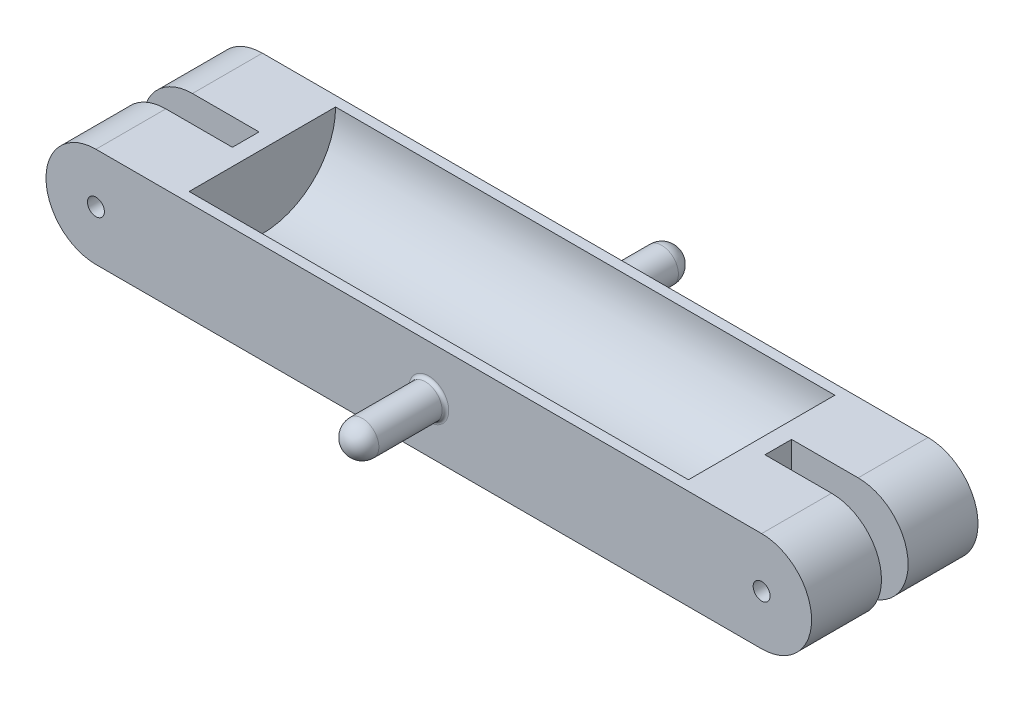
ISO-10303-21;
HEADER;
FILE_DESCRIPTION(('STEP AP214'),'2;1');
FILE_NAME('part.step','',(''),(''),'','','');
FILE_SCHEMA(('AUTOMOTIVE_DESIGN { 1 0 10303 214 1 1 1 1 }'));
ENDSEC;
DATA;
#1=APPLICATION_CONTEXT('core data for automotive mechanical design processes');
#2=APPLICATION_PROTOCOL_DEFINITION('international standard','automotive_design',2000,#1);
#3=PRODUCT_CONTEXT('',#1,'mechanical');
#4=PRODUCT('Part','Part','',(#3));
#5=PRODUCT_RELATED_PRODUCT_CATEGORY('part','',(#4));
#6=PRODUCT_DEFINITION_FORMATION('','',#4);
#7=PRODUCT_DEFINITION_CONTEXT('part definition',#1,'design');
#8=PRODUCT_DEFINITION('design','',#6,#7);
#9=PRODUCT_DEFINITION_SHAPE('','',#8);
#10=(LENGTH_UNIT() NAMED_UNIT(*) SI_UNIT(.MILLI.,.METRE.));
#11=(NAMED_UNIT(*) PLANE_ANGLE_UNIT() SI_UNIT($,.RADIAN.));
#12=(NAMED_UNIT(*) SI_UNIT($,.STERADIAN.) SOLID_ANGLE_UNIT());
#13=UNCERTAINTY_MEASURE_WITH_UNIT(LENGTH_MEASURE(1.E-05),#10,'distance_accuracy_value','');
#14=(GEOMETRIC_REPRESENTATION_CONTEXT(3) GLOBAL_UNCERTAINTY_ASSIGNED_CONTEXT((#13)) GLOBAL_UNIT_ASSIGNED_CONTEXT((#10,
#11,#12)) REPRESENTATION_CONTEXT('',''));
#15=CARTESIAN_POINT('',(0.,0.,0.));
#16=DIRECTION('',(0.,0.,1.));
#17=DIRECTION('',(1.,0.,0.));
#18=AXIS2_PLACEMENT_3D('',#15,#16,#17);
#19=CARTESIAN_POINT('',(0.,15.,50.));
#20=DIRECTION('',(0.,1.,0.));
#21=DIRECTION('',(-1.,0.,0.));
#22=AXIS2_PLACEMENT_3D('',#19,#20,#21);
#23=PLANE('',#22);
#24=DIRECTION('',(0.,0.,1.));
#25=VECTOR('',#24,1.);
#26=CARTESIAN_POINT('',(-80.,15.,29.));
#27=LINE('',#26,#25);
#28=CARTESIAN_POINT('',(-80.,15.,21.));
#29=VERTEX_POINT('',#28);
#30=CARTESIAN_POINT('',(-80.,15.,29.));
#31=VERTEX_POINT('',#30);
#32=EDGE_CURVE('E186',#29,#31,#27,.T.);
#33=ORIENTED_EDGE('',*,*,#32,.T.);
#34=DIRECTION('',(-1.,0.,0.));
#35=VECTOR('',#34,1.);
#36=CARTESIAN_POINT('',(-80.,15.,29.));
#37=LINE('',#36,#35);
#38=CARTESIAN_POINT('',(-100.,15.,29.));
#39=VERTEX_POINT('',#38);
#40=EDGE_CURVE('E196',#31,#39,#37,.T.);
#41=ORIENTED_EDGE('',*,*,#40,.T.);
#42=DIRECTION('',(0.,0.,-1.));
#43=VECTOR('',#42,1.);
#44=CARTESIAN_POINT('',(-100.,15.,50.));
#45=LINE('',#44,#43);
#46=CARTESIAN_POINT('',(-100.,15.,50.));
#47=VERTEX_POINT('',#46);
#48=EDGE_CURVE('E228',#47,#39,#45,.T.);
#49=ORIENTED_EDGE('',*,*,#48,.F.);
#50=DIRECTION('',(1.,0.,0.));
#51=VECTOR('',#50,1.);
#52=CARTESIAN_POINT('',(0.,15.,50.));
#53=LINE('',#52,#51);
#54=CARTESIAN_POINT('',(100.,15.,50.));
#55=VERTEX_POINT('',#54);
#56=EDGE_CURVE('E273',#47,#55,#53,.T.);
#57=ORIENTED_EDGE('',*,*,#56,.T.);
#58=DIRECTION('',(0.,0.,-1.));
#59=VECTOR('',#58,1.);
#60=CARTESIAN_POINT('',(100.,15.,50.));
#61=LINE('',#60,#59);
#62=CARTESIAN_POINT('',(100.,15.,29.));
#63=VERTEX_POINT('',#62);
#64=EDGE_CURVE('E294',#55,#63,#61,.T.);
#65=ORIENTED_EDGE('',*,*,#64,.T.);
#66=DIRECTION('',(1.,0.,0.));
#67=VECTOR('',#66,1.);
#68=CARTESIAN_POINT('',(80.,15.,29.));
#69=LINE('',#68,#67);
#70=CARTESIAN_POINT('',(80.,15.,29.));
#71=VERTEX_POINT('',#70);
#72=EDGE_CURVE('E251',#71,#63,#69,.T.);
#73=ORIENTED_EDGE('',*,*,#72,.F.);
#74=DIRECTION('',(0.,0.,1.));
#75=VECTOR('',#74,1.);
#76=CARTESIAN_POINT('',(80.,15.,29.));
#77=LINE('',#76,#75);
#78=CARTESIAN_POINT('',(80.,15.,21.));
#79=VERTEX_POINT('',#78);
#80=EDGE_CURVE('E177',#79,#71,#77,.T.);
#81=ORIENTED_EDGE('',*,*,#80,.F.);
#82=DIRECTION('',(-1.,0.,0.));
#83=VECTOR('',#82,1.);
#84=CARTESIAN_POINT('',(80.,15.,21.));
#85=LINE('',#84,#83);
#86=CARTESIAN_POINT('',(100.,15.,21.));
#87=VERTEX_POINT('',#86);
#88=EDGE_CURVE('E243',#87,#79,#85,.T.);
#89=ORIENTED_EDGE('',*,*,#88,.F.);
#90=CARTESIAN_POINT('',(100.,15.,0.));
#91=VERTEX_POINT('',#90);
#92=EDGE_CURVE('E281',#87,#91,#61,.T.);
#93=ORIENTED_EDGE('',*,*,#92,.T.);
#94=DIRECTION('',(1.,0.,0.));
#95=VECTOR('',#94,1.);
#96=CARTESIAN_POINT('',(0.,15.,0.));
#97=LINE('',#96,#95);
#98=CARTESIAN_POINT('',(-100.,15.,0.));
#99=VERTEX_POINT('',#98);
#100=EDGE_CURVE('E270',#99,#91,#97,.T.);
#101=ORIENTED_EDGE('',*,*,#100,.F.);
#102=CARTESIAN_POINT('',(-100.,15.,21.));
#103=VERTEX_POINT('',#102);
#104=EDGE_CURVE('E231',#103,#99,#45,.T.);
#105=ORIENTED_EDGE('',*,*,#104,.F.);
#106=DIRECTION('',(1.,0.,0.));
#107=VECTOR('',#106,1.);
#108=CARTESIAN_POINT('',(-80.,15.,21.));
#109=LINE('',#108,#107);
#110=EDGE_CURVE('E189',#103,#29,#109,.T.);
#111=ORIENTED_EDGE('',*,*,#110,.T.);
#112=EDGE_LOOP('',(#33,#41,#49,#57,#65,#73,#81,#89,#93,#101,#105,#111));
#113=FACE_BOUND('',#112,.T.);
#114=DIRECTION('',(-1.,0.,0.));
#115=VECTOR('',#114,1.);
#116=CARTESIAN_POINT('',(75.,15.,47.));
#117=LINE('',#116,#115);
#118=CARTESIAN_POINT('',(75.,15.,47.));
#119=VERTEX_POINT('',#118);
#120=CARTESIAN_POINT('',(-75.,15.,47.));
#121=VERTEX_POINT('',#120);
#122=EDGE_CURVE('E178',#119,#121,#117,.T.);
#123=ORIENTED_EDGE('',*,*,#122,.T.);
#124=DIRECTION('',(0.,0.,-1.));
#125=VECTOR('',#124,1.);
#126=CARTESIAN_POINT('',(-75.,15.,3.));
#127=LINE('',#126,#125);
#128=CARTESIAN_POINT('',(-75.,15.,3.));
#129=VERTEX_POINT('',#128);
#130=EDGE_CURVE('E183',#121,#129,#127,.T.);
#131=ORIENTED_EDGE('',*,*,#130,.T.);
#132=DIRECTION('',(-1.,0.,0.));
#133=VECTOR('',#132,1.);
#134=CARTESIAN_POINT('',(75.,15.,3.));
#135=LINE('',#134,#133);
#136=CARTESIAN_POINT('',(75.,15.,3.));
#137=VERTEX_POINT('',#136);
#138=EDGE_CURVE('E170',#137,#129,#135,.T.);
#139=ORIENTED_EDGE('',*,*,#138,.F.);
#140=DIRECTION('',(0.,0.,-1.));
#141=VECTOR('',#140,1.);
#142=CARTESIAN_POINT('',(75.,15.,3.));
#143=LINE('',#142,#141);
#144=EDGE_CURVE('E236',#119,#137,#143,.T.);
#145=ORIENTED_EDGE('',*,*,#144,.F.);
#146=EDGE_LOOP('',(#123,#131,#139,#145));
#147=FACE_BOUND('',#146,.T.);
#148=ADVANCED_FACE('F69',(#113,#147),#23,.T.);
#149=CARTESIAN_POINT('',(100.,-15.,50.));
#150=DIRECTION('',(0.,-1.,0.));
#151=DIRECTION('',(1.,0.,0.));
#152=AXIS2_PLACEMENT_3D('',#149,#150,#151);
#153=PLANE('',#152);
#154=DIRECTION('',(0.,0.,-1.));
#155=VECTOR('',#154,1.);
#156=CARTESIAN_POINT('',(-100.,-15.,50.));
#157=LINE('',#156,#155);
#158=CARTESIAN_POINT('',(-100.,-15.,50.));
#159=VERTEX_POINT('',#158);
#160=CARTESIAN_POINT('',(-100.,-15.,29.));
#161=VERTEX_POINT('',#160);
#162=EDGE_CURVE('E232',#159,#161,#157,.T.);
#163=ORIENTED_EDGE('',*,*,#162,.T.);
#164=DIRECTION('',(-1.,0.,0.));
#165=VECTOR('',#164,1.);
#166=CARTESIAN_POINT('',(-80.,-15.,29.));
#167=LINE('',#166,#165);
#168=CARTESIAN_POINT('',(-80.,-15.,29.));
#169=VERTEX_POINT('',#168);
#170=EDGE_CURVE('E198',#169,#161,#167,.T.);
#171=ORIENTED_EDGE('',*,*,#170,.F.);
#172=DIRECTION('',(0.,0.,1.));
#173=VECTOR('',#172,1.);
#174=CARTESIAN_POINT('',(-80.,-15.,29.));
#175=LINE('',#174,#173);
#176=CARTESIAN_POINT('',(-80.,-15.,21.));
#177=VERTEX_POINT('',#176);
#178=EDGE_CURVE('E193',#177,#169,#175,.T.);
#179=ORIENTED_EDGE('',*,*,#178,.F.);
#180=DIRECTION('',(1.,0.,0.));
#181=VECTOR('',#180,1.);
#182=CARTESIAN_POINT('',(-80.,-15.,21.));
#183=LINE('',#182,#181);
#184=CARTESIAN_POINT('',(-100.,-15.,21.));
#185=VERTEX_POINT('',#184);
#186=EDGE_CURVE('E195',#185,#177,#183,.T.);
#187=ORIENTED_EDGE('',*,*,#186,.F.);
#188=CARTESIAN_POINT('',(-100.,-15.,0.));
#189=VERTEX_POINT('',#188);
#190=EDGE_CURVE('E225',#185,#189,#157,.T.);
#191=ORIENTED_EDGE('',*,*,#190,.T.);
#192=DIRECTION('',(-1.,0.,0.));
#193=VECTOR('',#192,1.);
#194=CARTESIAN_POINT('',(100.,-15.,0.));
#195=LINE('',#194,#193);
#196=CARTESIAN_POINT('',(100.,-15.,0.));
#197=VERTEX_POINT('',#196);
#198=EDGE_CURVE('E277',#197,#189,#195,.T.);
#199=ORIENTED_EDGE('',*,*,#198,.F.);
#200=DIRECTION('',(0.,0.,-1.));
#201=VECTOR('',#200,1.);
#202=CARTESIAN_POINT('',(100.,-15.,50.));
#203=LINE('',#202,#201);
#204=CARTESIAN_POINT('',(100.,-15.,21.));
#205=VERTEX_POINT('',#204);
#206=EDGE_CURVE('E293',#205,#197,#203,.T.);
#207=ORIENTED_EDGE('',*,*,#206,.F.);
#208=DIRECTION('',(-1.,0.,0.));
#209=VECTOR('',#208,1.);
#210=CARTESIAN_POINT('',(80.,-15.,21.));
#211=LINE('',#210,#209);
#212=CARTESIAN_POINT('',(80.,-15.,21.));
#213=VERTEX_POINT('',#212);
#214=EDGE_CURVE('E246',#205,#213,#211,.T.);
#215=ORIENTED_EDGE('',*,*,#214,.T.);
#216=DIRECTION('',(0.,0.,1.));
#217=VECTOR('',#216,1.);
#218=CARTESIAN_POINT('',(80.,-15.,29.));
#219=LINE('',#218,#217);
#220=CARTESIAN_POINT('',(80.,-15.,29.));
#221=VERTEX_POINT('',#220);
#222=EDGE_CURVE('E239',#213,#221,#219,.T.);
#223=ORIENTED_EDGE('',*,*,#222,.T.);
#224=DIRECTION('',(1.,0.,0.));
#225=VECTOR('',#224,1.);
#226=CARTESIAN_POINT('',(80.,-15.,29.));
#227=LINE('',#226,#225);
#228=CARTESIAN_POINT('',(100.,-15.,29.));
#229=VERTEX_POINT('',#228);
#230=EDGE_CURVE('E242',#221,#229,#227,.T.);
#231=ORIENTED_EDGE('',*,*,#230,.T.);
#232=CARTESIAN_POINT('',(100.,-15.,50.));
#233=VERTEX_POINT('',#232);
#234=EDGE_CURVE('E289',#233,#229,#203,.T.);
#235=ORIENTED_EDGE('',*,*,#234,.F.);
#236=DIRECTION('',(-1.,0.,0.));
#237=VECTOR('',#236,1.);
#238=CARTESIAN_POINT('',(100.,-15.,50.));
#239=LINE('',#238,#237);
#240=EDGE_CURVE('E279',#233,#159,#239,.T.);
#241=ORIENTED_EDGE('',*,*,#240,.T.);
#242=EDGE_LOOP('',(#163,#171,#179,#187,#191,#199,#207,#215,#223,#231,#235,#241));
#243=FACE_BOUND('',#242,.T.);
#244=ADVANCED_FACE('F325',(#243),#153,.T.);
#245=CARTESIAN_POINT('',(-100.,0.,50.));
#246=DIRECTION('',(0.,0.,-1.));
#247=DIRECTION('',(-1.,0.,0.));
#248=AXIS2_PLACEMENT_3D('',#245,#246,#247);
#249=CYLINDRICAL_SURFACE('',#248,15.);
#250=CARTESIAN_POINT('',(-100.,0.,29.));
#251=DIRECTION('',(0.,0.,-1.));
#252=DIRECTION('',(-1.,0.,0.));
#253=AXIS2_PLACEMENT_3D('',#250,#251,#252);
#254=CIRCLE('',#253,15.);
#255=EDGE_CURVE('E213',#39,#161,#254,.F.);
#256=ORIENTED_EDGE('',*,*,#255,.T.);
#257=ORIENTED_EDGE('',*,*,#162,.F.);
#258=CARTESIAN_POINT('',(-100.,0.,50.));
#259=DIRECTION('',(0.,0.,-1.));
#260=DIRECTION('',(-1.,0.,0.));
#261=AXIS2_PLACEMENT_3D('',#258,#259,#260);
#262=CIRCLE('',#261,15.);
#263=EDGE_CURVE('E222',#159,#47,#262,.T.);
#264=ORIENTED_EDGE('',*,*,#263,.T.);
#265=ORIENTED_EDGE('',*,*,#48,.T.);
#266=EDGE_LOOP('',(#256,#257,#264,#265));
#267=FACE_BOUND('',#266,.T.);
#268=ADVANCED_FACE('F332',(#267),#249,.T.);
#269=ORIENTED_EDGE('',*,*,#190,.F.);
#270=CARTESIAN_POINT('',(-100.,0.,21.));
#271=DIRECTION('',(0.,0.,1.));
#272=DIRECTION('',(1.,0.,0.));
#273=AXIS2_PLACEMENT_3D('',#270,#271,#272);
#274=CIRCLE('',#273,15.);
#275=EDGE_CURVE('E84',#185,#103,#274,.F.);
#276=ORIENTED_EDGE('',*,*,#275,.T.);
#277=ORIENTED_EDGE('',*,*,#104,.T.);
#278=CARTESIAN_POINT('',(-100.,0.,0.));
#279=DIRECTION('',(0.,0.,-1.));
#280=DIRECTION('',(-1.,0.,0.));
#281=AXIS2_PLACEMENT_3D('',#278,#279,#280);
#282=CIRCLE('',#281,15.);
#283=EDGE_CURVE('E219',#189,#99,#282,.T.);
#284=ORIENTED_EDGE('',*,*,#283,.F.);
#285=EDGE_LOOP('',(#269,#276,#277,#284));
#286=FACE_BOUND('',#285,.T.);
#287=ADVANCED_FACE('F373',(#286),#249,.T.);
#288=CARTESIAN_POINT('',(-100.,0.,50.));
#289=DIRECTION('',(0.,0.,-1.));
#290=DIRECTION('',(-1.,0.,0.));
#291=AXIS2_PLACEMENT_3D('',#288,#289,#290);
#292=CYLINDRICAL_SURFACE('',#291,2.54999999999999);
#293=CARTESIAN_POINT('',(-100.,0.,50.));
#294=DIRECTION('',(0.,0.,-1.));
#295=DIRECTION('',(-1.,0.,0.));
#296=AXIS2_PLACEMENT_3D('',#293,#294,#295);
#297=CIRCLE('',#296,2.54999999999999);
#298=CARTESIAN_POINT('',(-102.55,0.,50.));
#299=VERTEX_POINT('',#298);
#300=EDGE_CURVE('E216',#299,#299,#297,.T.);
#301=ORIENTED_EDGE('',*,*,#300,.F.);
#302=EDGE_LOOP('',(#301));
#303=FACE_BOUND('',#302,.T.);
#304=CARTESIAN_POINT('',(-100.,0.,29.));
#305=DIRECTION('',(0.,0.,-1.));
#306=DIRECTION('',(-1.,0.,0.));
#307=AXIS2_PLACEMENT_3D('',#304,#305,#306);
#308=CIRCLE('',#307,2.54999999999999);
#309=CARTESIAN_POINT('',(-102.55,0.,29.));
#310=VERTEX_POINT('',#309);
#311=EDGE_CURVE('E212',#310,#310,#308,.F.);
#312=ORIENTED_EDGE('',*,*,#311,.F.);
#313=EDGE_LOOP('',(#312));
#314=FACE_BOUND('',#313,.T.);
#315=ADVANCED_FACE('F375',(#303,#314),#292,.F.);
#316=CARTESIAN_POINT('',(-100.,0.,0.));
#317=DIRECTION('',(0.,0.,-1.));
#318=DIRECTION('',(-1.,0.,0.));
#319=AXIS2_PLACEMENT_3D('',#316,#317,#318);
#320=CIRCLE('',#319,2.54999999999999);
#321=CARTESIAN_POINT('',(-102.55,0.,0.));
#322=VERTEX_POINT('',#321);
#323=EDGE_CURVE('E215',#322,#322,#320,.T.);
#324=ORIENTED_EDGE('',*,*,#323,.T.);
#325=EDGE_LOOP('',(#324));
#326=FACE_BOUND('',#325,.T.);
#327=CARTESIAN_POINT('',(-100.,0.,21.));
#328=DIRECTION('',(0.,0.,1.));
#329=DIRECTION('',(1.,0.,0.));
#330=AXIS2_PLACEMENT_3D('',#327,#328,#329);
#331=CIRCLE('',#330,2.54999999999999);
#332=CARTESIAN_POINT('',(-97.45,0.,21.));
#333=VERTEX_POINT('',#332);
#334=EDGE_CURVE('E209',#333,#333,#331,.F.);
#335=ORIENTED_EDGE('',*,*,#334,.F.);
#336=EDGE_LOOP('',(#335));
#337=FACE_BOUND('',#336,.T.);
#338=ADVANCED_FACE('F378',(#326,#337),#292,.F.);
#339=CARTESIAN_POINT('',(100.,0.,50.));
#340=DIRECTION('',(0.,0.,-1.));
#341=DIRECTION('',(-1.,0.,0.));
#342=AXIS2_PLACEMENT_3D('',#339,#340,#341);
#343=CYLINDRICAL_SURFACE('',#342,15.);
#344=ORIENTED_EDGE('',*,*,#92,.F.);
#345=CARTESIAN_POINT('',(100.,0.,21.));
#346=DIRECTION('',(0.,0.,-1.));
#347=DIRECTION('',(-1.,0.,0.));
#348=AXIS2_PLACEMENT_3D('',#345,#346,#347);
#349=CIRCLE('',#348,15.);
#350=EDGE_CURVE('E264',#87,#205,#349,.T.);
#351=ORIENTED_EDGE('',*,*,#350,.T.);
#352=ORIENTED_EDGE('',*,*,#206,.T.);
#353=CARTESIAN_POINT('',(100.,0.,0.));
#354=DIRECTION('',(0.,0.,1.));
#355=DIRECTION('',(1.,0.,0.));
#356=AXIS2_PLACEMENT_3D('',#353,#354,#355);
#357=CIRCLE('',#356,15.);
#358=EDGE_CURVE('E284',#197,#91,#357,.T.);
#359=ORIENTED_EDGE('',*,*,#358,.T.);
#360=EDGE_LOOP('',(#344,#351,#352,#359));
#361=FACE_BOUND('',#360,.T.);
#362=ADVANCED_FACE('F341',(#361),#343,.T.);
#363=CARTESIAN_POINT('',(100.,0.,50.));
#364=DIRECTION('',(0.,0.,-1.));
#365=DIRECTION('',(-1.,0.,0.));
#366=AXIS2_PLACEMENT_3D('',#363,#364,#365);
#367=CYLINDRICAL_SURFACE('',#366,2.54999999999999);
#368=CARTESIAN_POINT('',(100.,0.,21.));
#369=DIRECTION('',(0.,0.,-1.));
#370=DIRECTION('',(-1.,0.,0.));
#371=AXIS2_PLACEMENT_3D('',#368,#369,#370);
#372=CIRCLE('',#371,2.54999999999999);
#373=CARTESIAN_POINT('',(97.45,0.,21.));
#374=VERTEX_POINT('',#373);
#375=EDGE_CURVE('E263',#374,#374,#372,.T.);
#376=ORIENTED_EDGE('',*,*,#375,.F.);
#377=EDGE_LOOP('',(#376));
#378=FACE_BOUND('',#377,.T.);
#379=CARTESIAN_POINT('',(100.,0.,0.));
#380=DIRECTION('',(0.,0.,1.));
#381=DIRECTION('',(1.,0.,0.));
#382=AXIS2_PLACEMENT_3D('',#379,#380,#381);
#383=CIRCLE('',#382,2.54999999999999);
#384=CARTESIAN_POINT('',(102.55,0.,0.));
#385=VERTEX_POINT('',#384);
#386=EDGE_CURVE('E266',#385,#385,#383,.T.);
#387=ORIENTED_EDGE('',*,*,#386,.F.);
#388=EDGE_LOOP('',(#387));
#389=FACE_BOUND('',#388,.T.);
#390=ADVANCED_FACE('F349',(#378,#389),#367,.F.);
#391=CARTESIAN_POINT('',(100.,0.,50.));
#392=DIRECTION('',(0.,0.,1.));
#393=DIRECTION('',(1.,0.,0.));
#394=AXIS2_PLACEMENT_3D('',#391,#392,#393);
#395=PLANE('',#394);
#396=CARTESIAN_POINT('',(0.,0.,50.));
#397=DIRECTION('',(0.,0.,1.));
#398=DIRECTION('',(1.,0.,0.));
#399=AXIS2_PLACEMENT_3D('',#396,#397,#398);
#400=CIRCLE('',#399,6.);
#401=CARTESIAN_POINT('',(6.,0.,50.));
#402=VERTEX_POINT('',#401);
#403=EDGE_CURVE('E12',#402,#402,#400,.F.);
#404=ORIENTED_EDGE('',*,*,#403,.T.);
#405=EDGE_LOOP('',(#404));
#406=FACE_BOUND('',#405,.T.);
#407=ORIENTED_EDGE('',*,*,#56,.F.);
#408=ORIENTED_EDGE('',*,*,#263,.F.);
#409=ORIENTED_EDGE('',*,*,#240,.F.);
#410=CARTESIAN_POINT('',(100.,0.,50.));
#411=DIRECTION('',(0.,0.,1.));
#412=DIRECTION('',(1.,0.,0.));
#413=AXIS2_PLACEMENT_3D('',#410,#411,#412);
#414=CIRCLE('',#413,15.);
#415=EDGE_CURVE('E276',#233,#55,#414,.T.);
#416=ORIENTED_EDGE('',*,*,#415,.T.);
#417=EDGE_LOOP('',(#407,#408,#409,#416));
#418=FACE_BOUND('',#417,.T.);
#419=CARTESIAN_POINT('',(100.,0.,50.));
#420=DIRECTION('',(0.,0.,1.));
#421=DIRECTION('',(1.,0.,0.));
#422=AXIS2_PLACEMENT_3D('',#419,#420,#421);
#423=CIRCLE('',#422,2.54999999999999);
#424=CARTESIAN_POINT('',(102.55,0.,50.));
#425=VERTEX_POINT('',#424);
#426=EDGE_CURVE('E267',#425,#425,#423,.T.);
#427=ORIENTED_EDGE('',*,*,#426,.F.);
#428=EDGE_LOOP('',(#427));
#429=FACE_BOUND('',#428,.T.);
#430=ORIENTED_EDGE('',*,*,#300,.T.);
#431=EDGE_LOOP('',(#430));
#432=FACE_BOUND('',#431,.T.);
#433=ADVANCED_FACE('F345',(#406,#418,#429,#432),#395,.T.);
#434=CARTESIAN_POINT('',(100.,0.,0.));
#435=DIRECTION('',(0.,0.,1.));
#436=DIRECTION('',(1.,0.,0.));
#437=AXIS2_PLACEMENT_3D('',#434,#435,#436);
#438=PLANE('',#437);
#439=CARTESIAN_POINT('',(0.,0.,0.));
#440=DIRECTION('',(0.,0.,1.));
#441=DIRECTION('',(1.,0.,0.));
#442=AXIS2_PLACEMENT_3D('',#439,#440,#441);
#443=CIRCLE('',#442,6.);
#444=CARTESIAN_POINT('',(6.,0.,0.));
#445=VERTEX_POINT('',#444);
#446=EDGE_CURVE('E292',#445,#445,#443,.T.);
#447=ORIENTED_EDGE('',*,*,#446,.T.);
#448=EDGE_LOOP('',(#447));
#449=FACE_BOUND('',#448,.T.);
#450=ORIENTED_EDGE('',*,*,#198,.T.);
#451=ORIENTED_EDGE('',*,*,#283,.T.);
#452=ORIENTED_EDGE('',*,*,#100,.T.);
#453=ORIENTED_EDGE('',*,*,#358,.F.);
#454=EDGE_LOOP('',(#450,#451,#452,#453));
#455=FACE_BOUND('',#454,.T.);
#456=ORIENTED_EDGE('',*,*,#386,.T.);
#457=EDGE_LOOP('',(#456));
#458=FACE_BOUND('',#457,.T.);
#459=ORIENTED_EDGE('',*,*,#323,.F.);
#460=EDGE_LOOP('',(#459));
#461=FACE_BOUND('',#460,.T.);
#462=ADVANCED_FACE('F339',(#449,#455,#458,#461),#438,.F.);
#463=CARTESIAN_POINT('',(100.,0.,29.));
#464=DIRECTION('',(0.,0.,1.));
#465=DIRECTION('',(1.,0.,0.));
#466=AXIS2_PLACEMENT_3D('',#463,#464,#465);
#467=CIRCLE('',#466,15.);
#468=EDGE_CURVE('E261',#229,#63,#467,.T.);
#469=ORIENTED_EDGE('',*,*,#468,.T.);
#470=ORIENTED_EDGE('',*,*,#64,.F.);
#471=ORIENTED_EDGE('',*,*,#415,.F.);
#472=ORIENTED_EDGE('',*,*,#234,.T.);
#473=EDGE_LOOP('',(#469,#470,#471,#472));
#474=FACE_BOUND('',#473,.T.);
#475=ADVANCED_FACE('F336',(#474),#343,.T.);
#476=CARTESIAN_POINT('',(100.,0.,29.));
#477=DIRECTION('',(0.,0.,1.));
#478=DIRECTION('',(1.,0.,0.));
#479=AXIS2_PLACEMENT_3D('',#476,#477,#478);
#480=CIRCLE('',#479,2.54999999999999);
#481=CARTESIAN_POINT('',(102.55,0.,29.));
#482=VERTEX_POINT('',#481);
#483=EDGE_CURVE('E258',#482,#482,#480,.T.);
#484=ORIENTED_EDGE('',*,*,#483,.F.);
#485=EDGE_LOOP('',(#484));
#486=FACE_BOUND('',#485,.T.);
#487=ORIENTED_EDGE('',*,*,#426,.T.);
#488=EDGE_LOOP('',(#487));
#489=FACE_BOUND('',#488,.T.);
#490=ADVANCED_FACE('F338',(#486,#489),#367,.F.);
#491=CARTESIAN_POINT('',(80.,-15.,21.));
#492=DIRECTION('',(0.,0.,-1.));
#493=DIRECTION('',(-1.,0.,0.));
#494=AXIS2_PLACEMENT_3D('',#491,#492,#493);
#495=PLANE('',#494);
#496=ORIENTED_EDGE('',*,*,#375,.T.);
#497=EDGE_LOOP('',(#496));
#498=FACE_BOUND('',#497,.T.);
#499=ORIENTED_EDGE('',*,*,#88,.T.);
#500=DIRECTION('',(0.,1.,0.));
#501=VECTOR('',#500,1.);
#502=CARTESIAN_POINT('',(80.,-15.,21.));
#503=LINE('',#502,#501);
#504=EDGE_CURVE('E255',#213,#79,#503,.T.);
#505=ORIENTED_EDGE('',*,*,#504,.F.);
#506=ORIENTED_EDGE('',*,*,#214,.F.);
#507=ORIENTED_EDGE('',*,*,#350,.F.);
#508=EDGE_LOOP('',(#499,#505,#506,#507));
#509=FACE_BOUND('',#508,.T.);
#510=ADVANCED_FACE('F353',(#498,#509),#495,.F.);
#511=CARTESIAN_POINT('',(80.,-15.,29.));
#512=DIRECTION('',(0.,0.,1.));
#513=DIRECTION('',(1.,0.,0.));
#514=AXIS2_PLACEMENT_3D('',#511,#512,#513);
#515=PLANE('',#514);
#516=ORIENTED_EDGE('',*,*,#483,.T.);
#517=EDGE_LOOP('',(#516));
#518=FACE_BOUND('',#517,.T.);
#519=ORIENTED_EDGE('',*,*,#468,.F.);
#520=ORIENTED_EDGE('',*,*,#230,.F.);
#521=DIRECTION('',(0.,1.,0.));
#522=VECTOR('',#521,1.);
#523=CARTESIAN_POINT('',(80.,-15.,29.));
#524=LINE('',#523,#522);
#525=EDGE_CURVE('E249',#221,#71,#524,.T.);
#526=ORIENTED_EDGE('',*,*,#525,.T.);
#527=ORIENTED_EDGE('',*,*,#72,.T.);
#528=EDGE_LOOP('',(#519,#520,#526,#527));
#529=FACE_BOUND('',#528,.T.);
#530=ADVANCED_FACE('F358',(#518,#529),#515,.F.);
#531=CARTESIAN_POINT('',(80.,-15.,29.));
#532=DIRECTION('',(-1.,0.,0.));
#533=DIRECTION('',(0.,0.,1.));
#534=AXIS2_PLACEMENT_3D('',#531,#532,#533);
#535=PLANE('',#534);
#536=ORIENTED_EDGE('',*,*,#80,.T.);
#537=ORIENTED_EDGE('',*,*,#525,.F.);
#538=ORIENTED_EDGE('',*,*,#222,.F.);
#539=ORIENTED_EDGE('',*,*,#504,.T.);
#540=EDGE_LOOP('',(#536,#537,#538,#539));
#541=FACE_BOUND('',#540,.T.);
#542=ADVANCED_FACE('F355',(#541),#535,.F.);
#543=CARTESIAN_POINT('',(75.,15.,25.));
#544=DIRECTION('',(-1.,0.,0.));
#545=DIRECTION('',(0.,-1.,0.));
#546=AXIS2_PLACEMENT_3D('',#543,#544,#545);
#547=CYLINDRICAL_SURFACE('',#546,22.);
#548=ORIENTED_EDGE('',*,*,#138,.T.);
#549=CARTESIAN_POINT('',(-75.,15.,25.));
#550=DIRECTION('',(-1.,0.,0.));
#551=DIRECTION('',(0.,-1.,0.));
#552=AXIS2_PLACEMENT_3D('',#549,#550,#551);
#553=CIRCLE('',#552,22.);
#554=EDGE_CURVE('E173',#129,#121,#553,.T.);
#555=ORIENTED_EDGE('',*,*,#554,.T.);
#556=ORIENTED_EDGE('',*,*,#122,.F.);
#557=CARTESIAN_POINT('',(75.,15.,25.));
#558=DIRECTION('',(-1.,0.,0.));
#559=DIRECTION('',(0.,-1.,0.));
#560=AXIS2_PLACEMENT_3D('',#557,#558,#559);
#561=CIRCLE('',#560,22.);
#562=EDGE_CURVE('E91',#137,#119,#561,.T.);
#563=ORIENTED_EDGE('',*,*,#562,.F.);
#564=EDGE_LOOP('',(#548,#555,#556,#563));
#565=FACE_BOUND('',#564,.T.);
#566=ADVANCED_FACE('F172',(#565),#547,.F.);
#567=CARTESIAN_POINT('',(75.,15.,25.));
#568=DIRECTION('',(-1.,0.,0.));
#569=DIRECTION('',(0.,-1.,0.));
#570=AXIS2_PLACEMENT_3D('',#567,#568,#569);
#571=PLANE('',#570);
#572=ORIENTED_EDGE('',*,*,#562,.T.);
#573=ORIENTED_EDGE('',*,*,#144,.T.);
#574=EDGE_LOOP('',(#572,#573));
#575=FACE_BOUND('',#574,.T.);
#576=ADVANCED_FACE('F368',(#575),#571,.T.);
#577=CARTESIAN_POINT('',(-80.,-15.,29.));
#578=DIRECTION('',(0.,0.,-1.));
#579=DIRECTION('',(-1.,0.,0.));
#580=AXIS2_PLACEMENT_3D('',#577,#578,#579);
#581=PLANE('',#580);
#582=ORIENTED_EDGE('',*,*,#255,.F.);
#583=ORIENTED_EDGE('',*,*,#40,.F.);
#584=DIRECTION('',(0.,1.,0.));
#585=VECTOR('',#584,1.);
#586=CARTESIAN_POINT('',(-80.,-15.,29.));
#587=LINE('',#586,#585);
#588=EDGE_CURVE('E206',#169,#31,#587,.T.);
#589=ORIENTED_EDGE('',*,*,#588,.F.);
#590=ORIENTED_EDGE('',*,*,#170,.T.);
#591=EDGE_LOOP('',(#582,#583,#589,#590));
#592=FACE_BOUND('',#591,.T.);
#593=ORIENTED_EDGE('',*,*,#311,.T.);
#594=EDGE_LOOP('',(#593));
#595=FACE_BOUND('',#594,.T.);
#596=ADVANCED_FACE('F370',(#592,#595),#581,.T.);
#597=CARTESIAN_POINT('',(-80.,-15.,21.));
#598=DIRECTION('',(0.,0.,1.));
#599=DIRECTION('',(1.,0.,0.));
#600=AXIS2_PLACEMENT_3D('',#597,#598,#599);
#601=PLANE('',#600);
#602=ORIENTED_EDGE('',*,*,#186,.T.);
#603=DIRECTION('',(0.,1.,0.));
#604=VECTOR('',#603,1.);
#605=CARTESIAN_POINT('',(-80.,-15.,21.));
#606=LINE('',#605,#604);
#607=EDGE_CURVE('E200',#177,#29,#606,.T.);
#608=ORIENTED_EDGE('',*,*,#607,.T.);
#609=ORIENTED_EDGE('',*,*,#110,.F.);
#610=ORIENTED_EDGE('',*,*,#275,.F.);
#611=EDGE_LOOP('',(#602,#608,#609,#610));
#612=FACE_BOUND('',#611,.T.);
#613=ORIENTED_EDGE('',*,*,#334,.T.);
#614=EDGE_LOOP('',(#613));
#615=FACE_BOUND('',#614,.T.);
#616=ADVANCED_FACE('F383',(#612,#615),#601,.T.);
#617=CARTESIAN_POINT('',(-80.,-15.,29.));
#618=DIRECTION('',(-1.,0.,0.));
#619=DIRECTION('',(0.,0.,1.));
#620=AXIS2_PLACEMENT_3D('',#617,#618,#619);
#621=PLANE('',#620);
#622=ORIENTED_EDGE('',*,*,#32,.F.);
#623=ORIENTED_EDGE('',*,*,#607,.F.);
#624=ORIENTED_EDGE('',*,*,#178,.T.);
#625=ORIENTED_EDGE('',*,*,#588,.T.);
#626=EDGE_LOOP('',(#622,#623,#624,#625));
#627=FACE_BOUND('',#626,.T.);
#628=ADVANCED_FACE('F380',(#627),#621,.T.);
#629=CARTESIAN_POINT('',(-75.,15.,25.));
#630=DIRECTION('',(1.,0.,0.));
#631=DIRECTION('',(0.,-1.,0.));
#632=AXIS2_PLACEMENT_3D('',#629,#630,#631);
#633=PLANE('',#632);
#634=ORIENTED_EDGE('',*,*,#554,.F.);
#635=ORIENTED_EDGE('',*,*,#130,.F.);
#636=EDGE_LOOP('',(#634,#635));
#637=FACE_BOUND('',#636,.T.);
#638=ADVANCED_FACE('F182',(#637),#633,.T.);
#639=CARTESIAN_POINT('',(0.,0.,70.));
#640=DIRECTION('',(0.,0.,-1.));
#641=DIRECTION('',(-1.,0.,0.));
#642=AXIS2_PLACEMENT_3D('',#639,#640,#641);
#643=CYLINDRICAL_SURFACE('',#642,5.);
#644=CARTESIAN_POINT('',(0.,0.,51.));
#645=DIRECTION('',(0.,0.,1.));
#646=DIRECTION('',(1.,0.,0.));
#647=AXIS2_PLACEMENT_3D('',#644,#645,#646);
#648=CIRCLE('',#647,5.);
#649=CARTESIAN_POINT('',(5.,0.,51.));
#650=VERTEX_POINT('',#649);
#651=EDGE_CURVE('E77',#650,#650,#648,.T.);
#652=ORIENTED_EDGE('',*,*,#651,.T.);
#653=EDGE_LOOP('',(#652));
#654=FACE_BOUND('',#653,.T.);
#655=CARTESIAN_POINT('',(0.,0.,70.));
#656=DIRECTION('',(0.,0.,1.));
#657=DIRECTION('',(1.,0.,0.));
#658=AXIS2_PLACEMENT_3D('',#655,#656,#657);
#659=CIRCLE('',#658,5.);
#660=CARTESIAN_POINT('',(5.,0.,70.));
#661=VERTEX_POINT('',#660);
#662=EDGE_CURVE('E184',#661,#661,#659,.T.);
#663=ORIENTED_EDGE('',*,*,#662,.F.);
#664=EDGE_LOOP('',(#663));
#665=FACE_BOUND('',#664,.T.);
#666=ADVANCED_FACE('F312',(#654,#665),#643,.T.);
#667=CARTESIAN_POINT('',(0.,0.,70.));
#668=DIRECTION('',(0.,1.,0.));
#669=DIRECTION('',(-1.,0.,0.));
#670=AXIS2_PLACEMENT_3D('',#667,#668,#669);
#671=SPHERICAL_SURFACE('',#670,5.);
#672=CARTESIAN_POINT('',(0.,0.,70.));
#673=DIRECTION('',(0.,0.,1.));
#674=DIRECTION('',(1.,0.,0.));
#675=AXIS2_PLACEMENT_3D('',#672,#673,#674);
#676=SPHERICAL_SURFACE('',#675,5.);
#677=ORIENTED_EDGE('',*,*,#662,.T.);
#678=EDGE_LOOP('',(#677));
#679=FACE_BOUND('',#678,.T.);
#680=ADVANCED_FACE('F395',(#679),#676,.T.);
#681=CARTESIAN_POINT('',(0.,0.,-20.));
#682=DIRECTION('',(0.,0.,1.));
#683=DIRECTION('',(1.,0.,0.));
#684=AXIS2_PLACEMENT_3D('',#681,#682,#683);
#685=CYLINDRICAL_SURFACE('',#684,5.);
#686=CARTESIAN_POINT('',(0.,0.,-1.));
#687=DIRECTION('',(0.,0.,1.));
#688=DIRECTION('',(1.,0.,0.));
#689=AXIS2_PLACEMENT_3D('',#686,#687,#688);
#690=CIRCLE('',#689,5.);
#691=CARTESIAN_POINT('',(5.,0.,-1.));
#692=VERTEX_POINT('',#691);
#693=EDGE_CURVE('E307',#692,#692,#690,.F.);
#694=ORIENTED_EDGE('',*,*,#693,.T.);
#695=EDGE_LOOP('',(#694));
#696=FACE_BOUND('',#695,.T.);
#697=CARTESIAN_POINT('',(0.,0.,-20.));
#698=DIRECTION('',(0.,0.,-1.));
#699=DIRECTION('',(-1.,0.,0.));
#700=AXIS2_PLACEMENT_3D('',#697,#698,#699);
#701=CIRCLE('',#700,5.);
#702=CARTESIAN_POINT('',(-5.,0.,-20.));
#703=VERTEX_POINT('',#702);
#704=EDGE_CURVE('E409',#703,#703,#701,.T.);
#705=ORIENTED_EDGE('',*,*,#704,.F.);
#706=EDGE_LOOP('',(#705));
#707=FACE_BOUND('',#706,.T.);
#708=ADVANCED_FACE('F398',(#696,#707),#685,.T.);
#709=CARTESIAN_POINT('',(0.,0.,-20.));
#710=DIRECTION('',(0.,1.,0.));
#711=DIRECTION('',(-1.,0.,0.));
#712=AXIS2_PLACEMENT_3D('',#709,#710,#711);
#713=SPHERICAL_SURFACE('',#712,5.);
#714=CARTESIAN_POINT('',(0.,0.,-20.));
#715=DIRECTION('',(0.,0.,-1.));
#716=DIRECTION('',(-1.,0.,0.));
#717=AXIS2_PLACEMENT_3D('',#714,#715,#716);
#718=SPHERICAL_SURFACE('',#717,5.);
#719=ORIENTED_EDGE('',*,*,#704,.T.);
#720=EDGE_LOOP('',(#719));
#721=FACE_BOUND('',#720,.T.);
#722=ADVANCED_FACE('F321',(#721),#718,.T.);
#723=CARTESIAN_POINT('',(0.,0.,-1.));
#724=DIRECTION('',(0.,0.,1.));
#725=DIRECTION('',(1.,0.,0.));
#726=AXIS2_PLACEMENT_3D('',#723,#724,#725);
#727=TOROIDAL_SURFACE('',#726,6.,1.);
#728=ORIENTED_EDGE('',*,*,#693,.F.);
#729=EDGE_LOOP('',(#728));
#730=FACE_BOUND('',#729,.T.);
#731=ORIENTED_EDGE('',*,*,#446,.F.);
#732=EDGE_LOOP('',(#731));
#733=FACE_BOUND('',#732,.T.);
#734=ADVANCED_FACE('F316',(#730,#733),#727,.F.);
#735=CARTESIAN_POINT('',(0.,0.,51.));
#736=DIRECTION('',(0.,0.,1.));
#737=DIRECTION('',(1.,0.,0.));
#738=AXIS2_PLACEMENT_3D('',#735,#736,#737);
#739=TOROIDAL_SURFACE('',#738,6.,1.);
#740=ORIENTED_EDGE('',*,*,#403,.F.);
#741=EDGE_LOOP('',(#740));
#742=FACE_BOUND('',#741,.T.);
#743=ORIENTED_EDGE('',*,*,#651,.F.);
#744=EDGE_LOOP('',(#743));
#745=FACE_BOUND('',#744,.T.);
#746=ADVANCED_FACE('F71',(#742,#745),#739,.F.);
#747=CLOSED_SHELL('',(#148,#244,#268,#287,#315,#338,#362,#390,#433,#462,#475,#490,#510,#530,
#542,#566,#576,#596,#616,#628,#638,#666,#680,#708,#722,#734,#746));
#748=MANIFOLD_SOLID_BREP('B2',#747);
#749=ADVANCED_BREP_SHAPE_REPRESENTATION('',(#18,#748),#14);
#750=SHAPE_DEFINITION_REPRESENTATION(#9,#749);
ENDSEC;
END-ISO-10303-21;
